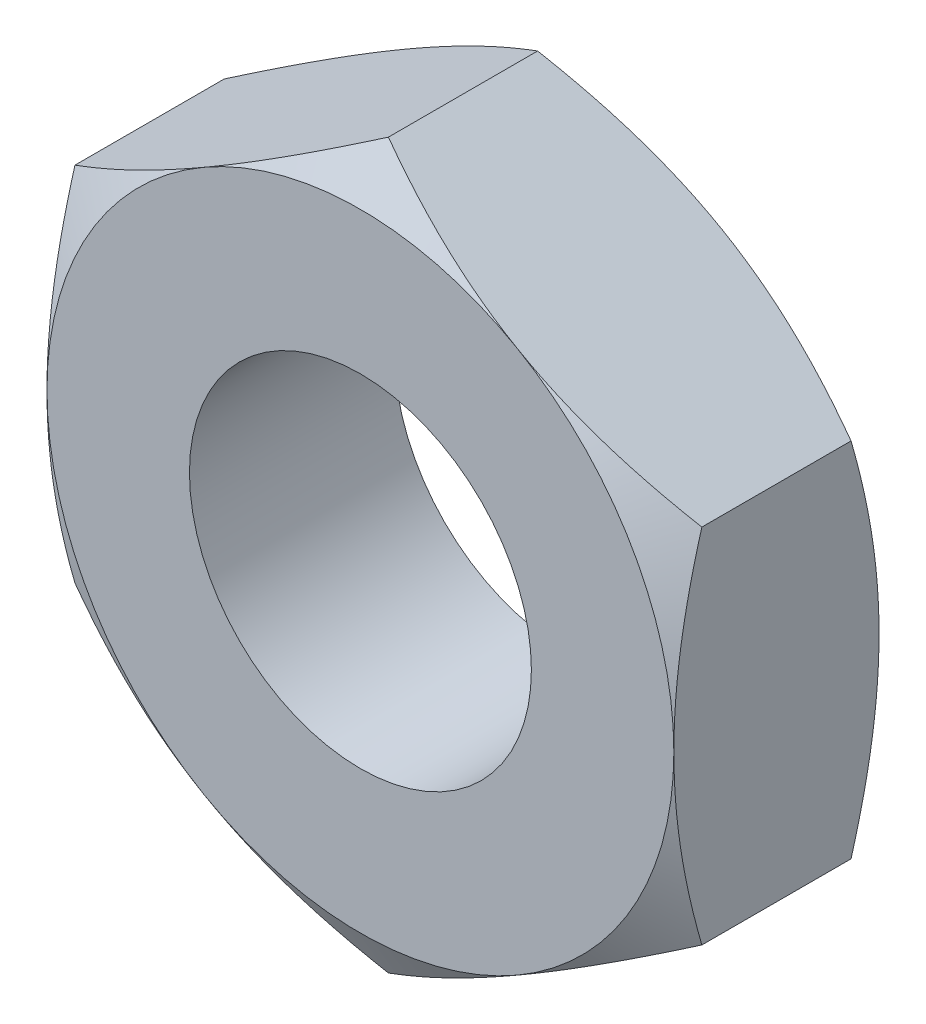
ISO-10303-21;
HEADER;
FILE_DESCRIPTION(('STEP AP214'),'2;1');
FILE_NAME('part.step','',(''),(''),'','','');
FILE_SCHEMA(('AUTOMOTIVE_DESIGN { 1 0 10303 214 1 1 1 1 }'));
ENDSEC;
DATA;
#1=APPLICATION_CONTEXT('core data for automotive mechanical design processes');
#2=APPLICATION_PROTOCOL_DEFINITION('international standard','automotive_design',2000,#1);
#3=PRODUCT_CONTEXT('',#1,'mechanical');
#4=PRODUCT('Part','Part','',(#3));
#5=PRODUCT_RELATED_PRODUCT_CATEGORY('part','',(#4));
#6=PRODUCT_DEFINITION_FORMATION('','',#4);
#7=PRODUCT_DEFINITION_CONTEXT('part definition',#1,'design');
#8=PRODUCT_DEFINITION('design','',#6,#7);
#9=PRODUCT_DEFINITION_SHAPE('','',#8);
#10=(LENGTH_UNIT() NAMED_UNIT(*) SI_UNIT(.MILLI.,.METRE.));
#11=(NAMED_UNIT(*) PLANE_ANGLE_UNIT() SI_UNIT($,.RADIAN.));
#12=(NAMED_UNIT(*) SI_UNIT($,.STERADIAN.) SOLID_ANGLE_UNIT());
#13=UNCERTAINTY_MEASURE_WITH_UNIT(LENGTH_MEASURE(1.E-05),#10,'distance_accuracy_value','');
#14=(GEOMETRIC_REPRESENTATION_CONTEXT(3) GLOBAL_UNCERTAINTY_ASSIGNED_CONTEXT((#13)) GLOBAL_UNIT_ASSIGNED_CONTEXT((#10,
#11,#12)) REPRESENTATION_CONTEXT('',''));
#15=CARTESIAN_POINT('',(0.,0.,0.));
#16=DIRECTION('',(0.,0.,1.));
#17=DIRECTION('',(1.,0.,0.));
#18=AXIS2_PLACEMENT_3D('',#15,#16,#17);
#19=CARTESIAN_POINT('',(-2.75,4.76313972081441,0.));
#20=DIRECTION('',(0.,0.,-1.));
#21=DIRECTION('',(-1.,0.,0.));
#22=AXIS2_PLACEMENT_3D('',#19,#20,#21);
#23=PLANE('',#22);
#24=CARTESIAN_POINT('',(0.,0.,0.));
#25=DIRECTION('',(0.,0.,1.));
#26=DIRECTION('',(1.,0.,0.));
#27=AXIS2_PLACEMENT_3D('',#24,#25,#26);
#28=CIRCLE('',#27,1.5);
#29=CARTESIAN_POINT('',(1.5,0.,0.));
#30=VERTEX_POINT('',#29);
#31=EDGE_CURVE('E335',#30,#30,#28,.T.);
#32=ORIENTED_EDGE('',*,*,#31,.F.);
#33=EDGE_LOOP('',(#32));
#34=FACE_BOUND('',#33,.T.);
#35=CARTESIAN_POINT('',(0.,0.,0.));
#36=DIRECTION('',(0.,0.,-1.));
#37=DIRECTION('',(-1.,0.,0.));
#38=AXIS2_PLACEMENT_3D('',#35,#36,#37);
#39=CIRCLE('',#38,2.75);
#40=CARTESIAN_POINT('',(-2.75,0.,0.));
#41=VERTEX_POINT('',#40);
#42=CARTESIAN_POINT('',(-1.375,2.38156986040721,0.));
#43=VERTEX_POINT('',#42);
#44=EDGE_CURVE('E343',#41,#43,#39,.T.);
#45=ORIENTED_EDGE('',*,*,#44,.F.);
#46=CARTESIAN_POINT('',(0.,0.,0.));
#47=DIRECTION('',(0.,0.,-1.));
#48=DIRECTION('',(-1.,0.,0.));
#49=AXIS2_PLACEMENT_3D('',#46,#47,#48);
#50=CIRCLE('',#49,2.75);
#51=CARTESIAN_POINT('',(-1.375,-2.38156986040721,0.));
#52=VERTEX_POINT('',#51);
#53=EDGE_CURVE('E154',#41,#52,#50,.F.);
#54=ORIENTED_EDGE('',*,*,#53,.T.);
#55=CARTESIAN_POINT('',(1.375,-2.38156986040721,0.));
#56=VERTEX_POINT('',#55);
#57=EDGE_CURVE('E264',#52,#56,#50,.F.);
#58=ORIENTED_EDGE('',*,*,#57,.T.);
#59=CARTESIAN_POINT('',(2.75,0.,0.));
#60=VERTEX_POINT('',#59);
#61=EDGE_CURVE('E157',#56,#60,#50,.F.);
#62=ORIENTED_EDGE('',*,*,#61,.T.);
#63=CARTESIAN_POINT('',(1.375,2.38156986040721,0.));
#64=VERTEX_POINT('',#63);
#65=EDGE_CURVE('E132',#60,#64,#50,.F.);
#66=ORIENTED_EDGE('',*,*,#65,.T.);
#67=EDGE_CURVE('E145',#64,#43,#50,.F.);
#68=ORIENTED_EDGE('',*,*,#67,.T.);
#69=EDGE_LOOP('',(#45,#54,#58,#62,#66,#68));
#70=FACE_BOUND('',#69,.T.);
#71=ADVANCED_FACE('F37',(#34,#70),#23,.F.);
#72=CARTESIAN_POINT('',(0.,0.,0.));
#73=DIRECTION('',(0.,0.,-1.));
#74=DIRECTION('',(-1.,0.,0.));
#75=AXIS2_PLACEMENT_3D('',#72,#73,#74);
#76=CONICAL_SURFACE('',#75,2.75,1.0471975511966);
#77=CARTESIAN_POINT('',(-2.75,-4.30229228147668,-1.36029280196869));
#78=CARTESIAN_POINT('',(-2.75,-4.18186505442104,-1.3017250140567));
#79=CARTESIAN_POINT('',(-2.75,-4.06116538069348,-1.24370803548682));
#80=CARTESIAN_POINT('',(-2.75,-3.81907640316823,-1.1290847342029));
#81=CARTESIAN_POINT('',(-2.75,-3.697686997625,-1.07247862661559));
#82=CARTESIAN_POINT('',(-2.75,-3.45346615214402,-0.960709275736212));
#83=CARTESIAN_POINT('',(-2.75,-3.33063048103345,-0.905555246476192));
#84=CARTESIAN_POINT('',(-2.75,-3.08399522164822,-0.797454597098009));
#85=CARTESIAN_POINT('',(-2.75,-2.96019567814277,-0.744507875173905));
#86=CARTESIAN_POINT('',(-2.75,-2.70729166016796,-0.639685660399076));
#87=CARTESIAN_POINT('',(-2.75,-2.57814783802132,-0.58790459291251));
#88=CARTESIAN_POINT('',(-2.75,-2.31836315787341,-0.488171403386151));
#89=CARTESIAN_POINT('',(-2.75,-2.18772213574267,-0.44021970581953));
#90=CARTESIAN_POINT('',(-2.75,-1.92496791263435,-0.349376696825143));
#91=CARTESIAN_POINT('',(-2.75,-1.79285817890918,-0.306475455624911));
#92=CARTESIAN_POINT('',(-2.75,-1.52674378198286,-0.227085219956575));
#93=CARTESIAN_POINT('',(-2.75,-1.39273971792532,-0.190594244981413));
#94=CARTESIAN_POINT('',(-2.75,-1.12351567917363,-0.12594817987629));
#95=CARTESIAN_POINT('',(-2.75,-0.988307144223034,-0.0977463139476861));
#96=CARTESIAN_POINT('',(-2.75,-0.716169711836455,-0.0512440134294212));
#97=CARTESIAN_POINT('',(-2.75,-0.579240989145488,-0.0329425812960641));
#98=CARTESIAN_POINT('',(-2.75,-0.306150866410057,-0.00793911298407926));
#99=CARTESIAN_POINT('',(-2.75,-0.170003735405166,-0.00108506805388398));
#100=CARTESIAN_POINT('',(-2.75,0.10238659817697,0.000845105282767546));
#101=CARTESIAN_POINT('',(-2.75,0.238629801806978,-0.00407889744443084));
#102=CARTESIAN_POINT('',(-2.75,0.468832296084481,-0.0219974968310409));
#103=CARTESIAN_POINT('',(-2.75,0.563033315185619,-0.032077711231205));
#104=CARTESIAN_POINT('',(-2.75,0.750767930146559,-0.0572609204033267));
#105=CARTESIAN_POINT('',(-2.75,0.844301437764612,-0.0723645671300336));
#106=CARTESIAN_POINT('',(-2.75,1.12375156526666,-0.124421461575699));
#107=CARTESIAN_POINT('',(-2.75,1.30841788504052,-0.168111837418328));
#108=CARTESIAN_POINT('',(-2.75,1.67808290983454,-0.269824298472284));
#109=CARTESIAN_POINT('',(-2.75,1.86299578104003,-0.328146457720436));
#110=CARTESIAN_POINT('',(-2.75,2.13779064230023,-0.422867035191401));
#111=CARTESIAN_POINT('',(-2.75,2.22895170938592,-0.455643485568147));
#112=CARTESIAN_POINT('',(-2.75,2.41051603082026,-0.523231455804624));
#113=CARTESIAN_POINT('',(-2.75,2.50091929547193,-0.558042947944627));
#114=CARTESIAN_POINT('',(-2.75,2.71959159850898,-0.644617652729879));
#115=CARTESIAN_POINT('',(-2.75,2.84751132012684,-0.697260776865983));
#116=CARTESIAN_POINT('',(-2.75,3.10220956373745,-0.805245997048298));
#117=CARTESIAN_POINT('',(-2.75,3.22898800879945,-0.860588273447927));
#118=CARTESIAN_POINT('',(-2.75,3.60796752116446,-1.02979754269534));
#119=CARTESIAN_POINT('',(-2.75,3.8587556505728,-1.14682372491926));
#120=CARTESIAN_POINT('',(-2.75,4.35800728856469,-1.38637465943305));
#121=CARTESIAN_POINT('',(-2.75,4.60646787012847,-1.50890543938444));
#122=CARTESIAN_POINT('',(-2.75,5.10156571292321,-1.75761178381209));
#123=CARTESIAN_POINT('',(-2.75,5.34820290174554,-1.8837874920658));
#124=CARTESIAN_POINT('',(-2.75,5.81846534399675,-2.12744912898035));
#125=CARTESIAN_POINT('',(-2.75,6.04220224364605,-2.24472037105475));
#126=CARTESIAN_POINT('',(-2.75,6.48884803452161,-2.48084931078627));
#127=CARTESIAN_POINT('',(-2.75,6.71175689181135,-2.59970707256807));
#128=CARTESIAN_POINT('',(-2.75,7.15632571780262,-2.83830005036305));
#129=CARTESIAN_POINT('',(-2.75,7.37798743393472,-2.95803201529397));
#130=CARTESIAN_POINT('',(-2.75,7.82078437408361,-3.19843421061186));
#131=CARTESIAN_POINT('',(-2.75,8.04191962909866,-3.31910438387787));
#132=CARTESIAN_POINT('',(-2.75,8.26286285963033,-3.44012269702325));
#133=B_SPLINE_CURVE_WITH_KNOTS('',3,(#77,#78,#79,#80,#81,#82,#83,#84,#85,#86,#87,#88,#89,#90,
#91,#92,#93,#94,#95,#96,#97,#98,#99,#100,#101,#102,#103,#104,#105,#106,#107,#108,#109,#110,#111,
#112,#113,#114,#115,#116,#117,#118,#119,#120,#121,#122,#123,#124,#125,#126,#127,#128,#129,#130,
#131,#132),.UNSPECIFIED.,.F.,.F.,(4,2,2,2,2,2,2,2,2,2,2,2,2,2,2,2,2,2,2,2,2,2,2,2,2,2,2,4),(0.,
0.401746095804053,0.803553078856815,1.20748507156767,1.61139841337565,2.02876570151725,
2.44617918943111,2.86275778118177,3.27920744014808,3.69325983350295,4.10727050016889,
4.51573852765934,4.9242111029455,5.20829154114386,5.49240886247226,6.06094297681273,
6.64225664207598,6.93286080176163,7.2234610039895,7.63840452536262,8.05337581074357,
8.8835032709366,9.71456302015113,10.5456555961473,11.3034719076264,12.0613189421837,
12.8171120728199,13.5728595432957),.UNSPECIFIED.);
#134=CARTESIAN_POINT('',(-2.75,1.58771324027148,-0.245620093061861));
#135=VERTEX_POINT('',#134);
#136=EDGE_CURVE('E162',#135,#41,#133,.F.);
#137=ORIENTED_EDGE('',*,*,#136,.T.);
#138=ORIENTED_EDGE('',*,*,#44,.T.);
#139=CARTESIAN_POINT('',(0.0002,3.17554195059678,-0.245686763364759));
#140=CARTESIAN_POINT('',(-0.120649220659906,3.10576962051743,-0.205387662249262));
#141=CARTESIAN_POINT('',(-0.242541602622634,3.03539502097908,-0.168736902597662));
#142=CARTESIAN_POINT('',(-0.488437126727893,2.89342717394439,-0.104762182969801));
#143=CARTESIAN_POINT('',(-0.612444638573856,2.82183140359859,-0.077460855674498));
#144=CARTESIAN_POINT('',(-0.858922797975944,2.67952717191843,-0.0349617452941179));
#145=CARTESIAN_POINT('',(-0.981355518587418,2.60884060771578,-0.0194811186224591));
#146=CARTESIAN_POINT('',(-1.22679714236892,2.46713482015519,-0.000999397369942066));
#147=CARTESIAN_POINT('',(-1.34980515323291,2.39611611197038,0.00201700053739859));
#148=CARTESIAN_POINT('',(-1.57965878661079,2.26341005486545,-0.00425314542854834));
#149=CARTESIAN_POINT('',(-1.68653879125402,2.20170285541369,-0.0120001542767039));
#150=CARTESIAN_POINT('',(-1.89960246733475,2.07869048467395,-0.036555181064356));
#151=CARTESIAN_POINT('',(-2.00578540164889,2.01738573896434,-0.0533715896505714));
#152=CARTESIAN_POINT('',(-2.21928848939318,1.89411967378235,-0.095411922345957));
#153=CARTESIAN_POINT('',(-2.32658161614286,1.83217395817123,-0.120814080687231));
#154=CARTESIAN_POINT('',(-2.53956747928405,1.70920651275308,-0.178467225839982));
#155=CARTESIAN_POINT('',(-2.64526294502665,1.64818320715447,-0.210704663298982));
#156=CARTESIAN_POINT('',(-2.7502,1.58759777021764,-0.245686763364759));
#157=B_SPLINE_CURVE_WITH_KNOTS('',3,(#139,#140,#141,#142,#143,#144,#145,#146,#147,#148,#149,
#150,#151,#152,#153,#154,#155,#156),.UNSPECIFIED.,.F.,.F.,(4,2,2,2,2,2,2,2,4),(0.,
0.435912828725888,0.872873557116332,1.29901931904671,1.72464171213574,2.09526089052937,
2.46622354066374,2.84541551798557,3.22386274754524),.UNSPECIFIED.);
#158=EDGE_CURVE('E197',#43,#135,#157,.T.);
#159=ORIENTED_EDGE('',*,*,#158,.T.);
#160=EDGE_LOOP('',(#137,#138,#159));
#161=FACE_BOUND('',#160,.T.);
#162=ADVANCED_FACE('F184',(#161),#76,.T.);
#163=CARTESIAN_POINT('',(2.7502,1.58759777021764,-0.245686763364759));
#164=CARTESIAN_POINT('',(2.62935077934009,1.65737010029699,-0.205387662249262));
#165=CARTESIAN_POINT('',(2.50745839737737,1.72774469983534,-0.168736902597662));
#166=CARTESIAN_POINT('',(2.26156287327211,1.86971254687003,-0.104762182969801));
#167=CARTESIAN_POINT('',(2.13755536142614,1.94130831721583,-0.0774608556744981));
#168=CARTESIAN_POINT('',(1.89107720202406,2.08361254889599,-0.0349617452941181));
#169=CARTESIAN_POINT('',(1.76864448141258,2.15429911309865,-0.0194811186224593));
#170=CARTESIAN_POINT('',(1.52320285763108,2.29600490065923,-0.000999397369942144));
#171=CARTESIAN_POINT('',(1.40019484676709,2.36702360884404,0.00201700053739861));
#172=CARTESIAN_POINT('',(1.17034121338921,2.49972966594897,-0.00425314542854836));
#173=CARTESIAN_POINT('',(1.06346120874598,2.56143686540073,-0.012000154276704));
#174=CARTESIAN_POINT('',(0.85039753266525,2.68444923614047,-0.0365551810643561));
#175=CARTESIAN_POINT('',(0.74421459835111,2.74575398185008,-0.0533715896505714));
#176=CARTESIAN_POINT('',(0.530711510606816,2.86902004703207,-0.095411922345957));
#177=CARTESIAN_POINT('',(0.423418383857144,2.93096576264319,-0.120814080687231));
#178=CARTESIAN_POINT('',(0.210432520715948,3.05393320806134,-0.178467225839982));
#179=CARTESIAN_POINT('',(0.104737054973347,3.11495651365995,-0.210704663298982));
#180=CARTESIAN_POINT('',(-0.000200000000000198,3.17554195059678,-0.245686763364759));
#181=B_SPLINE_CURVE_WITH_KNOTS('',3,(#163,#164,#165,#166,#167,#168,#169,#170,#171,#172,#173,
#174,#175,#176,#177,#178,#179,#180),.UNSPECIFIED.,.F.,.F.,(4,2,2,2,2,2,2,2,4),(0.,
0.435912828725888,0.872873557116332,1.29901931904671,1.72464171213574,2.09526089052937,
2.46622354066374,2.84541551798557,3.22386274754524),.UNSPECIFIED.);
#182=CARTESIAN_POINT('',(0.,3.17542648054294,-0.245620093061861));
#183=VERTEX_POINT('',#182);
#184=EDGE_CURVE('E141',#64,#183,#181,.T.);
#185=ORIENTED_EDGE('',*,*,#184,.T.);
#186=EDGE_CURVE('E148',#183,#43,#157,.T.);
#187=ORIENTED_EDGE('',*,*,#186,.T.);
#188=ORIENTED_EDGE('',*,*,#67,.F.);
#189=EDGE_LOOP('',(#185,#187,#188));
#190=FACE_BOUND('',#189,.T.);
#191=ADVANCED_FACE('F146',(#190),#76,.T.);
#192=CARTESIAN_POINT('',(2.75,-4.30229228147668,-1.36029280196869));
#193=CARTESIAN_POINT('',(2.75,-4.18186505442104,-1.3017250140567));
#194=CARTESIAN_POINT('',(2.75,-4.06116538069348,-1.24370803548682));
#195=CARTESIAN_POINT('',(2.75,-3.81907640316823,-1.1290847342029));
#196=CARTESIAN_POINT('',(2.75,-3.697686997625,-1.07247862661559));
#197=CARTESIAN_POINT('',(2.75,-3.45346615214402,-0.960709275736212));
#198=CARTESIAN_POINT('',(2.75,-3.33063048103345,-0.905555246476192));
#199=CARTESIAN_POINT('',(2.75,-3.08399522164822,-0.797454597098009));
#200=CARTESIAN_POINT('',(2.75,-2.96019567814277,-0.744507875173905));
#201=CARTESIAN_POINT('',(2.75,-2.70729166016796,-0.639685660399076));
#202=CARTESIAN_POINT('',(2.75,-2.57814783802132,-0.58790459291251));
#203=CARTESIAN_POINT('',(2.75,-2.31836315787341,-0.488171403386151));
#204=CARTESIAN_POINT('',(2.75,-2.18772213574267,-0.44021970581953));
#205=CARTESIAN_POINT('',(2.75,-1.92496791263435,-0.349376696825143));
#206=CARTESIAN_POINT('',(2.75,-1.79285817890918,-0.306475455624911));
#207=CARTESIAN_POINT('',(2.75,-1.52674378198286,-0.227085219956575));
#208=CARTESIAN_POINT('',(2.75,-1.39273971792532,-0.190594244981413));
#209=CARTESIAN_POINT('',(2.75,-1.12351567917363,-0.12594817987629));
#210=CARTESIAN_POINT('',(2.75,-0.988307144223034,-0.0977463139476861));
#211=CARTESIAN_POINT('',(2.75,-0.716169711836455,-0.0512440134294212));
#212=CARTESIAN_POINT('',(2.75,-0.579240989145488,-0.0329425812960641));
#213=CARTESIAN_POINT('',(2.75,-0.306150866410057,-0.00793911298407926));
#214=CARTESIAN_POINT('',(2.75,-0.170003735405166,-0.00108506805388398));
#215=CARTESIAN_POINT('',(2.75,0.10238659817697,0.000845105282767546));
#216=CARTESIAN_POINT('',(2.75,0.238629801806978,-0.00407889744443084));
#217=CARTESIAN_POINT('',(2.75,0.468832296084481,-0.0219974968310409));
#218=CARTESIAN_POINT('',(2.75,0.563033315185619,-0.032077711231205));
#219=CARTESIAN_POINT('',(2.75,0.750767930146559,-0.0572609204033267));
#220=CARTESIAN_POINT('',(2.75,0.844301437764612,-0.0723645671300336));
#221=CARTESIAN_POINT('',(2.75,1.12375156526666,-0.124421461575699));
#222=CARTESIAN_POINT('',(2.75,1.30841788504052,-0.168111837418328));
#223=CARTESIAN_POINT('',(2.75,1.67808290983454,-0.269824298472284));
#224=CARTESIAN_POINT('',(2.75,1.86299578104003,-0.328146457720436));
#225=CARTESIAN_POINT('',(2.75,2.13779064230023,-0.422867035191401));
#226=CARTESIAN_POINT('',(2.75,2.22895170938592,-0.455643485568147));
#227=CARTESIAN_POINT('',(2.75,2.41051603082026,-0.523231455804624));
#228=CARTESIAN_POINT('',(2.75,2.50091929547193,-0.558042947944627));
#229=CARTESIAN_POINT('',(2.75,2.71959159850898,-0.644617652729879));
#230=CARTESIAN_POINT('',(2.75,2.84751132012684,-0.697260776865983));
#231=CARTESIAN_POINT('',(2.75,3.10220956373745,-0.805245997048298));
#232=CARTESIAN_POINT('',(2.75,3.22898800879945,-0.860588273447927));
#233=CARTESIAN_POINT('',(2.75,3.60796752116446,-1.02979754269534));
#234=CARTESIAN_POINT('',(2.75,3.8587556505728,-1.14682372491926));
#235=CARTESIAN_POINT('',(2.75,4.35800728856469,-1.38637465943305));
#236=CARTESIAN_POINT('',(2.75,4.60646787012847,-1.50890543938444));
#237=CARTESIAN_POINT('',(2.75,5.10156571292321,-1.75761178381209));
#238=CARTESIAN_POINT('',(2.75,5.34820290174554,-1.8837874920658));
#239=CARTESIAN_POINT('',(2.75,5.81846534399675,-2.12744912898035));
#240=CARTESIAN_POINT('',(2.75,6.04220224364605,-2.24472037105475));
#241=CARTESIAN_POINT('',(2.75,6.48884803452161,-2.48084931078627));
#242=CARTESIAN_POINT('',(2.75,6.71175689181135,-2.59970707256807));
#243=CARTESIAN_POINT('',(2.75,7.15632571780262,-2.83830005036305));
#244=CARTESIAN_POINT('',(2.75,7.37798743393472,-2.95803201529397));
#245=CARTESIAN_POINT('',(2.75,7.82078437408361,-3.19843421061186));
#246=CARTESIAN_POINT('',(2.75,8.04191962909866,-3.31910438387787));
#247=CARTESIAN_POINT('',(2.75,8.26286285963033,-3.44012269702325));
#248=B_SPLINE_CURVE_WITH_KNOTS('',3,(#192,#193,#194,#195,#196,#197,#198,#199,#200,#201,#202,
#203,#204,#205,#206,#207,#208,#209,#210,#211,#212,#213,#214,#215,#216,#217,#218,#219,#220,#221,
#222,#223,#224,#225,#226,#227,#228,#229,#230,#231,#232,#233,#234,#235,#236,#237,#238,#239,#240,
#241,#242,#243,#244,#245,#246,#247),.UNSPECIFIED.,.F.,.F.,(4,2,2,2,2,2,2,2,2,2,2,2,2,2,2,2,2,2,
2,2,2,2,2,2,2,2,2,4),(0.,0.401746095804053,0.803553078856815,1.20748507156767,1.61139841337565,
2.02876570151725,2.44617918943111,2.86275778118177,3.27920744014808,3.69325983350295,
4.10727050016889,4.51573852765934,4.9242111029455,5.20829154114386,5.49240886247226,
6.06094297681273,6.64225664207598,6.93286080176163,7.2234610039895,7.63840452536262,
8.05337581074357,8.8835032709366,9.71456302015113,10.5456555961473,11.3034719076264,
12.0613189421837,12.8171120728199,13.5728595432957),.UNSPECIFIED.);
#249=CARTESIAN_POINT('',(2.75,1.58771324027148,-0.245620093061861));
#250=VERTEX_POINT('',#249);
#251=EDGE_CURVE('E135',#60,#250,#248,.T.);
#252=ORIENTED_EDGE('',*,*,#251,.T.);
#253=EDGE_CURVE('E128',#250,#64,#181,.T.);
#254=ORIENTED_EDGE('',*,*,#253,.T.);
#255=ORIENTED_EDGE('',*,*,#65,.F.);
#256=EDGE_LOOP('',(#252,#254,#255));
#257=FACE_BOUND('',#256,.T.);
#258=ADVANCED_FACE('F130',(#257),#76,.T.);
#259=CARTESIAN_POINT('',(-0.0002,-3.17554195059678,-0.245686763364759));
#260=CARTESIAN_POINT('',(0.120649220659906,-3.10576962051743,-0.205387662249262));
#261=CARTESIAN_POINT('',(0.242541602622634,-3.03539502097908,-0.168736902597662));
#262=CARTESIAN_POINT('',(0.488437126727893,-2.89342717394439,-0.104762182969801));
#263=CARTESIAN_POINT('',(0.612444638573856,-2.82183140359859,-0.077460855674498));
#264=CARTESIAN_POINT('',(0.858922797975944,-2.67952717191843,-0.0349617452941179));
#265=CARTESIAN_POINT('',(0.981355518587418,-2.60884060771578,-0.0194811186224591));
#266=CARTESIAN_POINT('',(1.22679714236892,-2.46713482015519,-0.000999397369942066));
#267=CARTESIAN_POINT('',(1.34980515323291,-2.39611611197038,0.00201700053739859));
#268=CARTESIAN_POINT('',(1.57965878661079,-2.26341005486545,-0.00425314542854834));
#269=CARTESIAN_POINT('',(1.68653879125402,-2.20170285541369,-0.0120001542767039));
#270=CARTESIAN_POINT('',(1.89960246733475,-2.07869048467395,-0.036555181064356));
#271=CARTESIAN_POINT('',(2.00578540164889,-2.01738573896434,-0.0533715896505714));
#272=CARTESIAN_POINT('',(2.21928848939318,-1.89411967378235,-0.095411922345957));
#273=CARTESIAN_POINT('',(2.32658161614286,-1.83217395817123,-0.120814080687231));
#274=CARTESIAN_POINT('',(2.53956747928405,-1.70920651275308,-0.178467225839982));
#275=CARTESIAN_POINT('',(2.64526294502665,-1.64818320715447,-0.210704663298982));
#276=CARTESIAN_POINT('',(2.7502,-1.58759777021764,-0.245686763364759));
#277=B_SPLINE_CURVE_WITH_KNOTS('',3,(#259,#260,#261,#262,#263,#264,#265,#266,#267,#268,#269,
#270,#271,#272,#273,#274,#275,#276),.UNSPECIFIED.,.F.,.F.,(4,2,2,2,2,2,2,2,4),(0.,
0.435912828725888,0.872873557116332,1.29901931904671,1.72464171213574,2.09526089052937,
2.46622354066374,2.84541551798557,3.22386274754524),.UNSPECIFIED.);
#278=CARTESIAN_POINT('',(2.75,-1.5877132402717,-0.245620093061715));
#279=VERTEX_POINT('',#278);
#280=EDGE_CURVE('E213',#56,#279,#277,.T.);
#281=ORIENTED_EDGE('',*,*,#280,.T.);
#282=EDGE_CURVE('E212',#279,#60,#248,.T.);
#283=ORIENTED_EDGE('',*,*,#282,.T.);
#284=ORIENTED_EDGE('',*,*,#61,.F.);
#285=EDGE_LOOP('',(#281,#283,#284));
#286=FACE_BOUND('',#285,.T.);
#287=ADVANCED_FACE('F444',(#286),#76,.T.);
#288=CARTESIAN_POINT('',(0.,-3.17542648054294,-0.245620093061861));
#289=VERTEX_POINT('',#288);
#290=EDGE_CURVE('E274',#289,#56,#277,.T.);
#291=ORIENTED_EDGE('',*,*,#290,.T.);
#292=ORIENTED_EDGE('',*,*,#57,.F.);
#293=CARTESIAN_POINT('',(-2.7502,-1.58759777021764,-0.245686763364759));
#294=CARTESIAN_POINT('',(-2.62935077934009,-1.65737010029699,-0.205387662249262));
#295=CARTESIAN_POINT('',(-2.50745839737737,-1.72774469983534,-0.168736902597662));
#296=CARTESIAN_POINT('',(-2.26156287327211,-1.86971254687003,-0.104762182969801));
#297=CARTESIAN_POINT('',(-2.13755536142614,-1.94130831721583,-0.0774608556744981));
#298=CARTESIAN_POINT('',(-1.89107720202406,-2.08361254889599,-0.0349617452941181));
#299=CARTESIAN_POINT('',(-1.76864448141258,-2.15429911309865,-0.0194811186224593));
#300=CARTESIAN_POINT('',(-1.52320285763108,-2.29600490065923,-0.000999397369942144));
#301=CARTESIAN_POINT('',(-1.40019484676709,-2.36702360884404,0.00201700053739861));
#302=CARTESIAN_POINT('',(-1.17034121338921,-2.49972966594897,-0.00425314542854836));
#303=CARTESIAN_POINT('',(-1.06346120874598,-2.56143686540073,-0.012000154276704));
#304=CARTESIAN_POINT('',(-0.85039753266525,-2.68444923614047,-0.0365551810643561));
#305=CARTESIAN_POINT('',(-0.74421459835111,-2.74575398185008,-0.0533715896505714));
#306=CARTESIAN_POINT('',(-0.530711510606816,-2.86902004703207,-0.095411922345957));
#307=CARTESIAN_POINT('',(-0.423418383857144,-2.93096576264319,-0.120814080687231));
#308=CARTESIAN_POINT('',(-0.210432520715948,-3.05393320806134,-0.178467225839982));
#309=CARTESIAN_POINT('',(-0.104737054973347,-3.11495651365995,-0.210704663298982));
#310=CARTESIAN_POINT('',(0.000200000000000198,-3.17554195059678,-0.245686763364759));
#311=B_SPLINE_CURVE_WITH_KNOTS('',3,(#293,#294,#295,#296,#297,#298,#299,#300,#301,#302,#303,
#304,#305,#306,#307,#308,#309,#310),.UNSPECIFIED.,.F.,.F.,(4,2,2,2,2,2,2,2,4),(0.,
0.435912828725888,0.872873557116332,1.29901931904671,1.72464171213574,2.09526089052937,
2.46622354066374,2.84541551798557,3.22386274754524),.UNSPECIFIED.);
#312=EDGE_CURVE('E278',#52,#289,#311,.T.);
#313=ORIENTED_EDGE('',*,*,#312,.T.);
#314=EDGE_LOOP('',(#291,#292,#313));
#315=FACE_BOUND('',#314,.T.);
#316=ADVANCED_FACE('F190',(#315),#76,.T.);
#317=CARTESIAN_POINT('',(-2.75,-1.5877132402717,-0.245620093061715));
#318=VERTEX_POINT('',#317);
#319=EDGE_CURVE('E177',#318,#52,#311,.T.);
#320=ORIENTED_EDGE('',*,*,#319,.T.);
#321=ORIENTED_EDGE('',*,*,#53,.F.);
#322=EDGE_CURVE('E140',#41,#318,#133,.F.);
#323=ORIENTED_EDGE('',*,*,#322,.T.);
#324=EDGE_LOOP('',(#320,#321,#323));
#325=FACE_BOUND('',#324,.T.);
#326=ADVANCED_FACE('F283',(#325),#76,.T.);
#327=CARTESIAN_POINT('',(2.75,1.58771324027148,-1.8));
#328=DIRECTION('',(0.499999999999999,0.866025403784439,0.));
#329=DIRECTION('',(-0.866025403784439,0.499999999999999,0.));
#330=AXIS2_PLACEMENT_3D('',#327,#328,#329);
#331=PLANE('',#330);
#332=CARTESIAN_POINT('',(-0.0002,3.17554195059678,-1.55431323663524));
#333=CARTESIAN_POINT('',(0.120649220659906,3.10576962051743,-1.59461233775074));
#334=CARTESIAN_POINT('',(0.242541602622634,3.03539502097908,-1.63126309740234));
#335=CARTESIAN_POINT('',(0.488437126727893,2.89342717394439,-1.6952378170302));
#336=CARTESIAN_POINT('',(0.612444638573856,2.82183140359859,-1.7225391443255));
#337=CARTESIAN_POINT('',(0.858922797975944,2.67952717191843,-1.76503825470588));
#338=CARTESIAN_POINT('',(0.981355518587418,2.60884060771577,-1.78051888137754));
#339=CARTESIAN_POINT('',(1.22679714236892,2.46713482015519,-1.79900060263006));
#340=CARTESIAN_POINT('',(1.34980515323291,2.39611611197038,-1.8020170005374));
#341=CARTESIAN_POINT('',(1.57965878661079,2.26341005486545,-1.79574685457145));
#342=CARTESIAN_POINT('',(1.68653879125402,2.20170285541369,-1.7879998457233));
#343=CARTESIAN_POINT('',(1.89960246733475,2.07869048467395,-1.76344481893564));
#344=CARTESIAN_POINT('',(2.00578540164889,2.01738573896434,-1.74662841034943));
#345=CARTESIAN_POINT('',(2.21928848939318,1.89411967378235,-1.70458807765404));
#346=CARTESIAN_POINT('',(2.32658161614286,1.83217395817123,-1.67918591931277));
#347=CARTESIAN_POINT('',(2.53956747928405,1.70920651275308,-1.62153277416002));
#348=CARTESIAN_POINT('',(2.64526294502665,1.64818320715447,-1.58929533670102));
#349=CARTESIAN_POINT('',(2.7502,1.58759777021764,-1.55431323663524));
#350=B_SPLINE_CURVE_WITH_KNOTS('',3,(#332,#333,#334,#335,#336,#337,#338,#339,#340,#341,#342,
#343,#344,#345,#346,#347,#348,#349),.UNSPECIFIED.,.F.,.F.,(4,2,2,2,2,2,2,2,4),(0.,
0.435912828725888,0.872873557116332,1.29901931904672,1.72464171213574,2.09526089052937,
2.46622354066374,2.84541551798557,3.22386274754524),.UNSPECIFIED.);
#351=CARTESIAN_POINT('',(0.,3.17542648054294,-1.55437990693814));
#352=VERTEX_POINT('',#351);
#353=CARTESIAN_POINT('',(1.375,2.38156986040721,-1.8));
#354=VERTEX_POINT('',#353);
#355=EDGE_CURVE('E249',#352,#354,#350,.T.);
#356=ORIENTED_EDGE('',*,*,#355,.F.);
#357=DIRECTION('',(0.,0.,1.));
#358=VECTOR('',#357,1.);
#359=CARTESIAN_POINT('',(0.,3.17542648054294,-1.8));
#360=LINE('',#359,#358);
#361=EDGE_CURVE('E161',#352,#183,#360,.T.);
#362=ORIENTED_EDGE('',*,*,#361,.T.);
#363=ORIENTED_EDGE('',*,*,#184,.F.);
#364=ORIENTED_EDGE('',*,*,#253,.F.);
#365=DIRECTION('',(0.,0.,1.));
#366=VECTOR('',#365,1.);
#367=CARTESIAN_POINT('',(2.75,1.58771324027148,-1.8));
#368=LINE('',#367,#366);
#369=CARTESIAN_POINT('',(2.75,1.58771324027148,-1.55437990693814));
#370=VERTEX_POINT('',#369);
#371=EDGE_CURVE('E153',#370,#250,#368,.T.);
#372=ORIENTED_EDGE('',*,*,#371,.F.);
#373=EDGE_CURVE('E243',#354,#370,#350,.T.);
#374=ORIENTED_EDGE('',*,*,#373,.F.);
#375=EDGE_LOOP('',(#356,#362,#363,#364,#372,#374));
#376=FACE_BOUND('',#375,.T.);
#377=ADVANCED_FACE('F39',(#376),#331,.T.);
#378=CARTESIAN_POINT('',(2.75,-1.58771324027148,-1.8));
#379=DIRECTION('',(1.,0.,0.));
#380=DIRECTION('',(0.,0.,-1.));
#381=AXIS2_PLACEMENT_3D('',#378,#379,#380);
#382=PLANE('',#381);
#383=CARTESIAN_POINT('',(2.75,-4.30229228147668,-0.439707198031312));
#384=CARTESIAN_POINT('',(2.75,-4.18186505442105,-0.498274985943303));
#385=CARTESIAN_POINT('',(2.75,-4.06116538069348,-0.556291964513185));
#386=CARTESIAN_POINT('',(2.75,-3.81907640316823,-0.670915265797105));
#387=CARTESIAN_POINT('',(2.75,-3.697686997625,-0.727521373384408));
#388=CARTESIAN_POINT('',(2.75,-3.45346615214402,-0.83929072426379));
#389=CARTESIAN_POINT('',(2.75,-3.33063048103345,-0.894444753523809));
#390=CARTESIAN_POINT('',(2.75,-3.08399522164822,-1.00254540290199));
#391=CARTESIAN_POINT('',(2.75,-2.96019567814277,-1.0554921248261));
#392=CARTESIAN_POINT('',(2.75,-2.70729166016796,-1.16031433960093));
#393=CARTESIAN_POINT('',(2.75,-2.57814783802132,-1.21209540708749));
#394=CARTESIAN_POINT('',(2.75,-2.31836315787341,-1.31182859661385));
#395=CARTESIAN_POINT('',(2.75,-2.18772213574267,-1.35978029418047));
#396=CARTESIAN_POINT('',(2.75,-1.92496791263435,-1.45062330317486));
#397=CARTESIAN_POINT('',(2.75,-1.79285817890918,-1.49352454437509));
#398=CARTESIAN_POINT('',(2.75,-1.52674378198286,-1.57291478004343));
#399=CARTESIAN_POINT('',(2.75,-1.39273971792532,-1.60940575501859));
#400=CARTESIAN_POINT('',(2.75,-1.12351567917363,-1.67405182012371));
#401=CARTESIAN_POINT('',(2.75,-0.988307144223034,-1.70225368605231));
#402=CARTESIAN_POINT('',(2.75,-0.716169711836454,-1.74875598657058));
#403=CARTESIAN_POINT('',(2.75,-0.579240989145487,-1.76705741870394));
#404=CARTESIAN_POINT('',(2.75,-0.306150866410056,-1.79206088701592));
#405=CARTESIAN_POINT('',(2.75,-0.170003735405164,-1.79891493194612));
#406=CARTESIAN_POINT('',(2.75,0.102386598176971,-1.80084510528277));
#407=CARTESIAN_POINT('',(2.75,0.238629801806978,-1.79592110255557));
#408=CARTESIAN_POINT('',(2.75,0.468832296084481,-1.77800250316896));
#409=CARTESIAN_POINT('',(2.75,0.563033315185619,-1.7679222887688));
#410=CARTESIAN_POINT('',(2.75,0.75076793014656,-1.74273907959667));
#411=CARTESIAN_POINT('',(2.75,0.844301437764612,-1.72763543286997));
#412=CARTESIAN_POINT('',(2.75,1.12375156526666,-1.6755785384243));
#413=CARTESIAN_POINT('',(2.75,1.30841788504052,-1.63188816258167));
#414=CARTESIAN_POINT('',(2.75,1.67808290983454,-1.53017570152772));
#415=CARTESIAN_POINT('',(2.75,1.86299578104003,-1.47185354227956));
#416=CARTESIAN_POINT('',(2.75,2.13779064230023,-1.3771329648086));
#417=CARTESIAN_POINT('',(2.75,2.22895170938592,-1.34435651443185));
#418=CARTESIAN_POINT('',(2.75,2.41051603082027,-1.27676854419538));
#419=CARTESIAN_POINT('',(2.75,2.50091929547194,-1.24195705205537));
#420=CARTESIAN_POINT('',(2.75,2.71959159850898,-1.15538234727012));
#421=CARTESIAN_POINT('',(2.75,2.84751132012684,-1.10273922313402));
#422=CARTESIAN_POINT('',(2.75,3.10220956373745,-0.994754002951703));
#423=CARTESIAN_POINT('',(2.75,3.22898800879945,-0.939411726552075));
#424=CARTESIAN_POINT('',(2.75,3.60796752116446,-0.770202457304665));
#425=CARTESIAN_POINT('',(2.75,3.8587556505728,-0.65317627508074));
#426=CARTESIAN_POINT('',(2.75,4.35800728856469,-0.413625340566956));
#427=CARTESIAN_POINT('',(2.75,4.60646787012847,-0.291094560615558));
#428=CARTESIAN_POINT('',(2.75,5.10156571292321,-0.042388216187914));
#429=CARTESIAN_POINT('',(2.75,5.34820290174554,0.0837874920657999));
#430=CARTESIAN_POINT('',(2.75,5.81846534399675,0.327449128980342));
#431=CARTESIAN_POINT('',(2.75,6.04220224364605,0.44472037105475));
#432=CARTESIAN_POINT('',(2.75,6.48884803452161,0.680849310786269));
#433=CARTESIAN_POINT('',(2.75,6.71175689181135,0.799707072568062));
#434=CARTESIAN_POINT('',(2.75,7.15632571780262,1.03830005036305));
#435=CARTESIAN_POINT('',(2.75,7.37798743393472,1.15803201529397));
#436=CARTESIAN_POINT('',(2.75,7.82078437408362,1.39843421061186));
#437=CARTESIAN_POINT('',(2.75,8.04191962909866,1.51910438387786));
#438=CARTESIAN_POINT('',(2.75,8.26286285963033,1.64012269702325));
#439=B_SPLINE_CURVE_WITH_KNOTS('',3,(#383,#384,#385,#386,#387,#388,#389,#390,#391,#392,#393,
#394,#395,#396,#397,#398,#399,#400,#401,#402,#403,#404,#405,#406,#407,#408,#409,#410,#411,#412,
#413,#414,#415,#416,#417,#418,#419,#420,#421,#422,#423,#424,#425,#426,#427,#428,#429,#430,#431,
#432,#433,#434,#435,#436,#437,#438),.UNSPECIFIED.,.F.,.F.,(4,2,2,2,2,2,2,2,2,2,2,2,2,2,2,2,2,2,
2,2,2,2,2,2,2,2,2,4),(0.,0.401746095804055,0.803553078856816,1.20748507156767,1.61139841337565,
2.02876570151725,2.44617918943111,2.86275778118177,3.27920744014808,3.69325983350295,
4.10727050016889,4.51573852765934,4.9242111029455,5.20829154114387,5.49240886247227,
6.06094297681274,6.64225664207598,6.93286080176163,7.2234610039895,7.63840452536262,
8.05337581074357,8.88350327093661,9.71456302015113,10.5456555961473,11.3034719076264,
12.0613189421837,12.8171120728199,13.5728595432957),.UNSPECIFIED.);
#440=CARTESIAN_POINT('',(2.75,0.,-1.8));
#441=VERTEX_POINT('',#440);
#442=EDGE_CURVE('E236',#370,#441,#439,.F.);
#443=ORIENTED_EDGE('',*,*,#442,.F.);
#444=ORIENTED_EDGE('',*,*,#371,.T.);
#445=ORIENTED_EDGE('',*,*,#251,.F.);
#446=ORIENTED_EDGE('',*,*,#282,.F.);
#447=DIRECTION('',(0.,0.,1.));
#448=VECTOR('',#447,1.);
#449=CARTESIAN_POINT('',(2.75,-1.58771324027148,-1.8));
#450=LINE('',#449,#448);
#451=CARTESIAN_POINT('',(2.75,-1.58771324027148,-1.55437990693814));
#452=VERTEX_POINT('',#451);
#453=EDGE_CURVE('E251',#452,#279,#450,.T.);
#454=ORIENTED_EDGE('',*,*,#453,.F.);
#455=EDGE_CURVE('E229',#441,#452,#439,.F.);
#456=ORIENTED_EDGE('',*,*,#455,.F.);
#457=EDGE_LOOP('',(#443,#444,#445,#446,#454,#456));
#458=FACE_BOUND('',#457,.T.);
#459=ADVANCED_FACE('F220',(#458),#382,.T.);
#460=CARTESIAN_POINT('',(2.75,-1.58771324027148,-1.8));
#461=DIRECTION('',(0.499999999999999,-0.866025403784439,0.));
#462=DIRECTION('',(0.866025403784439,0.499999999999999,0.));
#463=AXIS2_PLACEMENT_3D('',#460,#461,#462);
#464=PLANE('',#463);
#465=CARTESIAN_POINT('',(2.7502,-1.58759777021764,-1.55431323663524));
#466=CARTESIAN_POINT('',(2.62935077934009,-1.65737010029699,-1.59461233775074));
#467=CARTESIAN_POINT('',(2.50745839737737,-1.72774469983534,-1.63126309740234));
#468=CARTESIAN_POINT('',(2.26156287327211,-1.86971254687003,-1.6952378170302));
#469=CARTESIAN_POINT('',(2.13755536142614,-1.94130831721583,-1.7225391443255));
#470=CARTESIAN_POINT('',(1.89107720202406,-2.08361254889599,-1.76503825470588));
#471=CARTESIAN_POINT('',(1.76864448141258,-2.15429911309865,-1.78051888137754));
#472=CARTESIAN_POINT('',(1.52320285763108,-2.29600490065923,-1.79900060263006));
#473=CARTESIAN_POINT('',(1.40019484676709,-2.36702360884404,-1.8020170005374));
#474=CARTESIAN_POINT('',(1.17034121338921,-2.49972966594897,-1.79574685457145));
#475=CARTESIAN_POINT('',(1.06346120874598,-2.56143686540073,-1.7879998457233));
#476=CARTESIAN_POINT('',(0.85039753266525,-2.68444923614047,-1.76344481893564));
#477=CARTESIAN_POINT('',(0.74421459835111,-2.74575398185008,-1.74662841034943));
#478=CARTESIAN_POINT('',(0.530711510606816,-2.86902004703207,-1.70458807765404));
#479=CARTESIAN_POINT('',(0.423418383857145,-2.93096576264319,-1.67918591931277));
#480=CARTESIAN_POINT('',(0.210432520715949,-3.05393320806134,-1.62153277416002));
#481=CARTESIAN_POINT('',(0.104737054973347,-3.11495651365995,-1.58929533670102));
#482=CARTESIAN_POINT('',(-0.000200000000000301,-3.17554195059678,-1.55431323663524));
#483=B_SPLINE_CURVE_WITH_KNOTS('',3,(#465,#466,#467,#468,#469,#470,#471,#472,#473,#474,#475,
#476,#477,#478,#479,#480,#481,#482),.UNSPECIFIED.,.F.,.F.,(4,2,2,2,2,2,2,2,4),(0.,
0.435912828725888,0.872873557116332,1.29901931904671,1.72464171213574,2.09526089052937,
2.46622354066374,2.84541551798557,3.22386274754524),.UNSPECIFIED.);
#484=CARTESIAN_POINT('',(1.375,-2.38156986040721,-1.8));
#485=VERTEX_POINT('',#484);
#486=EDGE_CURVE('E61',#452,#485,#483,.T.);
#487=ORIENTED_EDGE('',*,*,#486,.F.);
#488=ORIENTED_EDGE('',*,*,#453,.T.);
#489=ORIENTED_EDGE('',*,*,#280,.F.);
#490=ORIENTED_EDGE('',*,*,#290,.F.);
#491=DIRECTION('',(0.,0.,1.));
#492=VECTOR('',#491,1.);
#493=CARTESIAN_POINT('',(0.,-3.17542648054294,-1.8));
#494=LINE('',#493,#492);
#495=CARTESIAN_POINT('',(0.,-3.17542648054294,-1.55437990693814));
#496=VERTEX_POINT('',#495);
#497=EDGE_CURVE('E254',#496,#289,#494,.T.);
#498=ORIENTED_EDGE('',*,*,#497,.F.);
#499=EDGE_CURVE('E237',#485,#496,#483,.T.);
#500=ORIENTED_EDGE('',*,*,#499,.F.);
#501=EDGE_LOOP('',(#487,#488,#489,#490,#498,#500));
#502=FACE_BOUND('',#501,.T.);
#503=ADVANCED_FACE('F224',(#502),#464,.T.);
#504=CARTESIAN_POINT('',(-2.75,-1.58771324027148,-1.8));
#505=DIRECTION('',(-0.499999999999999,-0.866025403784439,0.));
#506=DIRECTION('',(0.866025403784439,-0.499999999999999,0.));
#507=AXIS2_PLACEMENT_3D('',#504,#505,#506);
#508=PLANE('',#507);
#509=CARTESIAN_POINT('',(0.0002,-3.17554195059678,-1.55431323663524));
#510=CARTESIAN_POINT('',(-0.120649220659906,-3.10576962051743,-1.59461233775074));
#511=CARTESIAN_POINT('',(-0.242541602622634,-3.03539502097908,-1.63126309740234));
#512=CARTESIAN_POINT('',(-0.488437126727893,-2.89342717394439,-1.6952378170302));
#513=CARTESIAN_POINT('',(-0.612444638573856,-2.82183140359859,-1.7225391443255));
#514=CARTESIAN_POINT('',(-0.858922797975944,-2.67952717191843,-1.76503825470588));
#515=CARTESIAN_POINT('',(-0.981355518587418,-2.60884060771577,-1.78051888137754));
#516=CARTESIAN_POINT('',(-1.22679714236892,-2.46713482015519,-1.79900060263006));
#517=CARTESIAN_POINT('',(-1.34980515323291,-2.39611611197038,-1.8020170005374));
#518=CARTESIAN_POINT('',(-1.57965878661079,-2.26341005486545,-1.79574685457145));
#519=CARTESIAN_POINT('',(-1.68653879125402,-2.20170285541369,-1.7879998457233));
#520=CARTESIAN_POINT('',(-1.89960246733475,-2.07869048467395,-1.76344481893564));
#521=CARTESIAN_POINT('',(-2.00578540164889,-2.01738573896434,-1.74662841034943));
#522=CARTESIAN_POINT('',(-2.21928848939318,-1.89411967378235,-1.70458807765404));
#523=CARTESIAN_POINT('',(-2.32658161614286,-1.83217395817123,-1.67918591931277));
#524=CARTESIAN_POINT('',(-2.53956747928405,-1.70920651275308,-1.62153277416002));
#525=CARTESIAN_POINT('',(-2.64526294502665,-1.64818320715447,-1.58929533670102));
#526=CARTESIAN_POINT('',(-2.7502,-1.58759777021764,-1.55431323663524));
#527=B_SPLINE_CURVE_WITH_KNOTS('',3,(#509,#510,#511,#512,#513,#514,#515,#516,#517,#518,#519,
#520,#521,#522,#523,#524,#525,#526),.UNSPECIFIED.,.F.,.F.,(4,2,2,2,2,2,2,2,4),(0.,
0.435912828725888,0.872873557116332,1.29901931904672,1.72464171213574,2.09526089052937,
2.46622354066374,2.84541551798557,3.22386274754524),.UNSPECIFIED.);
#528=CARTESIAN_POINT('',(-1.375,-2.38156986040721,-1.8));
#529=VERTEX_POINT('',#528);
#530=EDGE_CURVE('E54',#496,#529,#527,.T.);
#531=ORIENTED_EDGE('',*,*,#530,.F.);
#532=ORIENTED_EDGE('',*,*,#497,.T.);
#533=ORIENTED_EDGE('',*,*,#312,.F.);
#534=ORIENTED_EDGE('',*,*,#319,.F.);
#535=DIRECTION('',(0.,0.,1.));
#536=VECTOR('',#535,1.);
#537=CARTESIAN_POINT('',(-2.75,-1.58771324027148,-1.8));
#538=LINE('',#537,#536);
#539=CARTESIAN_POINT('',(-2.75,-1.5877132402717,-1.55437990693829));
#540=VERTEX_POINT('',#539);
#541=EDGE_CURVE('E257',#540,#318,#538,.T.);
#542=ORIENTED_EDGE('',*,*,#541,.F.);
#543=EDGE_CURVE('E298',#529,#540,#527,.T.);
#544=ORIENTED_EDGE('',*,*,#543,.F.);
#545=EDGE_LOOP('',(#531,#532,#533,#534,#542,#544));
#546=FACE_BOUND('',#545,.T.);
#547=ADVANCED_FACE('F288',(#546),#508,.T.);
#548=CARTESIAN_POINT('',(-2.75,-1.58771324027148,-1.8));
#549=DIRECTION('',(-1.,0.,0.));
#550=DIRECTION('',(0.,0.,1.));
#551=AXIS2_PLACEMENT_3D('',#548,#549,#550);
#552=PLANE('',#551);
#553=CARTESIAN_POINT('',(-2.75,-4.30229228147668,-0.439707198031312));
#554=CARTESIAN_POINT('',(-2.75,-4.18186505442105,-0.498274985943303));
#555=CARTESIAN_POINT('',(-2.75,-4.06116538069348,-0.556291964513185));
#556=CARTESIAN_POINT('',(-2.75,-3.81907640316823,-0.670915265797105));
#557=CARTESIAN_POINT('',(-2.75,-3.697686997625,-0.727521373384408));
#558=CARTESIAN_POINT('',(-2.75,-3.45346615214402,-0.83929072426379));
#559=CARTESIAN_POINT('',(-2.75,-3.33063048103345,-0.894444753523809));
#560=CARTESIAN_POINT('',(-2.75,-3.08399522164822,-1.00254540290199));
#561=CARTESIAN_POINT('',(-2.75,-2.96019567814277,-1.0554921248261));
#562=CARTESIAN_POINT('',(-2.75,-2.70729166016796,-1.16031433960093));
#563=CARTESIAN_POINT('',(-2.75,-2.57814783802132,-1.21209540708749));
#564=CARTESIAN_POINT('',(-2.75,-2.31836315787341,-1.31182859661385));
#565=CARTESIAN_POINT('',(-2.75,-2.18772213574267,-1.35978029418047));
#566=CARTESIAN_POINT('',(-2.75,-1.92496791263435,-1.45062330317486));
#567=CARTESIAN_POINT('',(-2.75,-1.79285817890918,-1.49352454437509));
#568=CARTESIAN_POINT('',(-2.75,-1.52674378198286,-1.57291478004343));
#569=CARTESIAN_POINT('',(-2.75,-1.39273971792532,-1.60940575501859));
#570=CARTESIAN_POINT('',(-2.75,-1.12351567917363,-1.67405182012371));
#571=CARTESIAN_POINT('',(-2.75,-0.988307144223034,-1.70225368605231));
#572=CARTESIAN_POINT('',(-2.75,-0.716169711836454,-1.74875598657058));
#573=CARTESIAN_POINT('',(-2.75,-0.579240989145487,-1.76705741870394));
#574=CARTESIAN_POINT('',(-2.75,-0.306150866410056,-1.79206088701592));
#575=CARTESIAN_POINT('',(-2.75,-0.170003735405164,-1.79891493194612));
#576=CARTESIAN_POINT('',(-2.75,0.102386598176971,-1.80084510528277));
#577=CARTESIAN_POINT('',(-2.75,0.238629801806978,-1.79592110255557));
#578=CARTESIAN_POINT('',(-2.75,0.468832296084481,-1.77800250316896));
#579=CARTESIAN_POINT('',(-2.75,0.563033315185619,-1.7679222887688));
#580=CARTESIAN_POINT('',(-2.75,0.75076793014656,-1.74273907959667));
#581=CARTESIAN_POINT('',(-2.75,0.844301437764612,-1.72763543286997));
#582=CARTESIAN_POINT('',(-2.75,1.12375156526666,-1.6755785384243));
#583=CARTESIAN_POINT('',(-2.75,1.30841788504052,-1.63188816258167));
#584=CARTESIAN_POINT('',(-2.75,1.67808290983454,-1.53017570152772));
#585=CARTESIAN_POINT('',(-2.75,1.86299578104003,-1.47185354227956));
#586=CARTESIAN_POINT('',(-2.75,2.13779064230023,-1.3771329648086));
#587=CARTESIAN_POINT('',(-2.75,2.22895170938592,-1.34435651443185));
#588=CARTESIAN_POINT('',(-2.75,2.41051603082027,-1.27676854419538));
#589=CARTESIAN_POINT('',(-2.75,2.50091929547194,-1.24195705205537));
#590=CARTESIAN_POINT('',(-2.75,2.71959159850898,-1.15538234727012));
#591=CARTESIAN_POINT('',(-2.75,2.84751132012684,-1.10273922313402));
#592=CARTESIAN_POINT('',(-2.75,3.10220956373745,-0.994754002951703));
#593=CARTESIAN_POINT('',(-2.75,3.22898800879945,-0.939411726552075));
#594=CARTESIAN_POINT('',(-2.75,3.60796752116446,-0.770202457304665));
#595=CARTESIAN_POINT('',(-2.75,3.8587556505728,-0.65317627508074));
#596=CARTESIAN_POINT('',(-2.75,4.35800728856469,-0.413625340566956));
#597=CARTESIAN_POINT('',(-2.75,4.60646787012847,-0.291094560615558));
#598=CARTESIAN_POINT('',(-2.75,5.10156571292321,-0.042388216187914));
#599=CARTESIAN_POINT('',(-2.75,5.34820290174554,0.0837874920657999));
#600=CARTESIAN_POINT('',(-2.75,5.81846534399675,0.327449128980342));
#601=CARTESIAN_POINT('',(-2.75,6.04220224364605,0.44472037105475));
#602=CARTESIAN_POINT('',(-2.75,6.48884803452161,0.680849310786269));
#603=CARTESIAN_POINT('',(-2.75,6.71175689181135,0.799707072568062));
#604=CARTESIAN_POINT('',(-2.75,7.15632571780262,1.03830005036305));
#605=CARTESIAN_POINT('',(-2.75,7.37798743393472,1.15803201529397));
#606=CARTESIAN_POINT('',(-2.75,7.82078437408362,1.39843421061186));
#607=CARTESIAN_POINT('',(-2.75,8.04191962909866,1.51910438387786));
#608=CARTESIAN_POINT('',(-2.75,8.26286285963033,1.64012269702325));
#609=B_SPLINE_CURVE_WITH_KNOTS('',3,(#553,#554,#555,#556,#557,#558,#559,#560,#561,#562,#563,
#564,#565,#566,#567,#568,#569,#570,#571,#572,#573,#574,#575,#576,#577,#578,#579,#580,#581,#582,
#583,#584,#585,#586,#587,#588,#589,#590,#591,#592,#593,#594,#595,#596,#597,#598,#599,#600,#601,
#602,#603,#604,#605,#606,#607,#608),.UNSPECIFIED.,.F.,.F.,(4,2,2,2,2,2,2,2,2,2,2,2,2,2,2,2,2,2,
2,2,2,2,2,2,2,2,2,4),(0.,0.401746095804055,0.803553078856816,1.20748507156767,1.61139841337565,
2.02876570151725,2.44617918943111,2.86275778118177,3.27920744014808,3.69325983350295,
4.10727050016889,4.51573852765934,4.9242111029455,5.20829154114387,5.49240886247227,
6.06094297681274,6.64225664207598,6.93286080176163,7.2234610039895,7.63840452536262,
8.05337581074357,8.88350327093661,9.71456302015113,10.5456555961473,11.3034719076264,
12.0613189421837,12.8171120728199,13.5728595432957),.UNSPECIFIED.);
#610=CARTESIAN_POINT('',(-2.75,0.,-1.8));
#611=VERTEX_POINT('',#610);
#612=EDGE_CURVE('E293',#540,#611,#609,.T.);
#613=ORIENTED_EDGE('',*,*,#612,.F.);
#614=ORIENTED_EDGE('',*,*,#541,.T.);
#615=ORIENTED_EDGE('',*,*,#322,.F.);
#616=ORIENTED_EDGE('',*,*,#136,.F.);
#617=DIRECTION('',(0.,0.,1.));
#618=VECTOR('',#617,1.);
#619=CARTESIAN_POINT('',(-2.75,1.58771324027148,-1.8));
#620=LINE('',#619,#618);
#621=CARTESIAN_POINT('',(-2.75,1.58771324027148,-1.55437990693814));
#622=VERTEX_POINT('',#621);
#623=EDGE_CURVE('E260',#622,#135,#620,.T.);
#624=ORIENTED_EDGE('',*,*,#623,.F.);
#625=EDGE_CURVE('E295',#611,#622,#609,.T.);
#626=ORIENTED_EDGE('',*,*,#625,.F.);
#627=EDGE_LOOP('',(#613,#614,#615,#616,#624,#626));
#628=FACE_BOUND('',#627,.T.);
#629=ADVANCED_FACE('F291',(#628),#552,.T.);
#630=CARTESIAN_POINT('',(-2.75,1.58771324027148,-1.8));
#631=DIRECTION('',(-0.499999999999999,0.866025403784439,0.));
#632=DIRECTION('',(-0.866025403784439,-0.499999999999999,0.));
#633=AXIS2_PLACEMENT_3D('',#630,#631,#632);
#634=PLANE('',#633);
#635=CARTESIAN_POINT('',(-2.7502,1.58759777021764,-1.55431323663524));
#636=CARTESIAN_POINT('',(-2.62935077934009,1.65737010029699,-1.59461233775074));
#637=CARTESIAN_POINT('',(-2.50745839737737,1.72774469983534,-1.63126309740234));
#638=CARTESIAN_POINT('',(-2.26156287327211,1.86971254687003,-1.6952378170302));
#639=CARTESIAN_POINT('',(-2.13755536142614,1.94130831721583,-1.7225391443255));
#640=CARTESIAN_POINT('',(-1.89107720202406,2.08361254889599,-1.76503825470588));
#641=CARTESIAN_POINT('',(-1.76864448141258,2.15429911309865,-1.78051888137754));
#642=CARTESIAN_POINT('',(-1.52320285763108,2.29600490065923,-1.79900060263006));
#643=CARTESIAN_POINT('',(-1.40019484676709,2.36702360884404,-1.8020170005374));
#644=CARTESIAN_POINT('',(-1.17034121338921,2.49972966594897,-1.79574685457145));
#645=CARTESIAN_POINT('',(-1.06346120874598,2.56143686540073,-1.7879998457233));
#646=CARTESIAN_POINT('',(-0.85039753266525,2.68444923614047,-1.76344481893564));
#647=CARTESIAN_POINT('',(-0.74421459835111,2.74575398185008,-1.74662841034943));
#648=CARTESIAN_POINT('',(-0.530711510606816,2.86902004703207,-1.70458807765404));
#649=CARTESIAN_POINT('',(-0.423418383857145,2.93096576264319,-1.67918591931277));
#650=CARTESIAN_POINT('',(-0.210432520715949,3.05393320806134,-1.62153277416002));
#651=CARTESIAN_POINT('',(-0.104737054973347,3.11495651365995,-1.58929533670102));
#652=CARTESIAN_POINT('',(0.000200000000000301,3.17554195059678,-1.55431323663524));
#653=B_SPLINE_CURVE_WITH_KNOTS('',3,(#635,#636,#637,#638,#639,#640,#641,#642,#643,#644,#645,
#646,#647,#648,#649,#650,#651,#652),.UNSPECIFIED.,.F.,.F.,(4,2,2,2,2,2,2,2,4),(0.,
0.435912828725888,0.872873557116332,1.29901931904671,1.72464171213574,2.09526089052937,
2.46622354066374,2.84541551798557,3.22386274754524),.UNSPECIFIED.);
#654=CARTESIAN_POINT('',(-1.375,2.38156986040721,-1.8));
#655=VERTEX_POINT('',#654);
#656=EDGE_CURVE('E300',#622,#655,#653,.T.);
#657=ORIENTED_EDGE('',*,*,#656,.F.);
#658=ORIENTED_EDGE('',*,*,#623,.T.);
#659=ORIENTED_EDGE('',*,*,#158,.F.);
#660=ORIENTED_EDGE('',*,*,#186,.F.);
#661=ORIENTED_EDGE('',*,*,#361,.F.);
#662=EDGE_CURVE('E279',#655,#352,#653,.T.);
#663=ORIENTED_EDGE('',*,*,#662,.F.);
#664=EDGE_LOOP('',(#657,#658,#659,#660,#661,#663));
#665=FACE_BOUND('',#664,.T.);
#666=ADVANCED_FACE('F315',(#665),#634,.T.);
#667=CARTESIAN_POINT('',(0.,0.,-0.900000000000001));
#668=DIRECTION('',(0.,0.,1.));
#669=DIRECTION('',(1.,0.,0.));
#670=AXIS2_PLACEMENT_3D('',#667,#668,#669);
#671=CONICAL_SURFACE('',#670,4.30884572681201,1.0471975511966);
#672=ORIENTED_EDGE('',*,*,#625,.T.);
#673=ORIENTED_EDGE('',*,*,#656,.T.);
#674=CARTESIAN_POINT('',(0.,0.,-1.8));
#675=DIRECTION('',(0.,0.,-1.));
#676=DIRECTION('',(-1.,0.,0.));
#677=AXIS2_PLACEMENT_3D('',#674,#675,#676);
#678=CIRCLE('',#677,2.75);
#679=EDGE_CURVE('E340',#611,#655,#678,.T.);
#680=ORIENTED_EDGE('',*,*,#679,.F.);
#681=EDGE_LOOP('',(#672,#673,#680));
#682=FACE_BOUND('',#681,.T.);
#683=ADVANCED_FACE('F192',(#682),#671,.T.);
#684=ORIENTED_EDGE('',*,*,#355,.T.);
#685=CARTESIAN_POINT('',(0.,0.,-1.8));
#686=DIRECTION('',(0.,0.,-1.));
#687=DIRECTION('',(-1.,0.,0.));
#688=AXIS2_PLACEMENT_3D('',#685,#686,#687);
#689=CIRCLE('',#688,2.75);
#690=EDGE_CURVE('E47',#354,#655,#689,.F.);
#691=ORIENTED_EDGE('',*,*,#690,.T.);
#692=ORIENTED_EDGE('',*,*,#662,.T.);
#693=EDGE_LOOP('',(#684,#691,#692));
#694=FACE_BOUND('',#693,.T.);
#695=ADVANCED_FACE('F325',(#694),#671,.T.);
#696=ORIENTED_EDGE('',*,*,#373,.T.);
#697=ORIENTED_EDGE('',*,*,#442,.T.);
#698=EDGE_CURVE('E267',#441,#354,#689,.F.);
#699=ORIENTED_EDGE('',*,*,#698,.T.);
#700=EDGE_LOOP('',(#696,#697,#699));
#701=FACE_BOUND('',#700,.T.);
#702=ADVANCED_FACE('F352',(#701),#671,.T.);
#703=ORIENTED_EDGE('',*,*,#455,.T.);
#704=ORIENTED_EDGE('',*,*,#486,.T.);
#705=EDGE_CURVE('E357',#485,#441,#689,.F.);
#706=ORIENTED_EDGE('',*,*,#705,.T.);
#707=EDGE_LOOP('',(#703,#704,#706));
#708=FACE_BOUND('',#707,.T.);
#709=ADVANCED_FACE('F355',(#708),#671,.T.);
#710=ORIENTED_EDGE('',*,*,#499,.T.);
#711=ORIENTED_EDGE('',*,*,#530,.T.);
#712=EDGE_CURVE('E46',#529,#485,#689,.F.);
#713=ORIENTED_EDGE('',*,*,#712,.T.);
#714=EDGE_LOOP('',(#710,#711,#713));
#715=FACE_BOUND('',#714,.T.);
#716=ADVANCED_FACE('F359',(#715),#671,.T.);
#717=ORIENTED_EDGE('',*,*,#543,.T.);
#718=ORIENTED_EDGE('',*,*,#612,.T.);
#719=EDGE_CURVE('E11',#611,#529,#689,.F.);
#720=ORIENTED_EDGE('',*,*,#719,.T.);
#721=EDGE_LOOP('',(#717,#718,#720));
#722=FACE_BOUND('',#721,.T.);
#723=ADVANCED_FACE('F327',(#722),#671,.T.);
#724=CARTESIAN_POINT('',(-2.75,4.76313972081441,-1.8));
#725=DIRECTION('',(0.,0.,-1.));
#726=DIRECTION('',(-1.,0.,0.));
#727=AXIS2_PLACEMENT_3D('',#724,#725,#726);
#728=PLANE('',#727);
#729=CARTESIAN_POINT('',(0.,0.,-1.8));
#730=DIRECTION('',(0.,0.,1.));
#731=DIRECTION('',(1.,0.,0.));
#732=AXIS2_PLACEMENT_3D('',#729,#730,#731);
#733=CIRCLE('',#732,1.5);
#734=CARTESIAN_POINT('',(1.5,0.,-1.8));
#735=VERTEX_POINT('',#734);
#736=EDGE_CURVE('E337',#735,#735,#733,.T.);
#737=ORIENTED_EDGE('',*,*,#736,.T.);
#738=EDGE_LOOP('',(#737));
#739=FACE_BOUND('',#738,.T.);
#740=ORIENTED_EDGE('',*,*,#719,.F.);
#741=ORIENTED_EDGE('',*,*,#679,.T.);
#742=ORIENTED_EDGE('',*,*,#690,.F.);
#743=ORIENTED_EDGE('',*,*,#698,.F.);
#744=ORIENTED_EDGE('',*,*,#705,.F.);
#745=ORIENTED_EDGE('',*,*,#712,.F.);
#746=EDGE_LOOP('',(#740,#741,#742,#743,#744,#745));
#747=FACE_BOUND('',#746,.T.);
#748=ADVANCED_FACE('F363',(#739,#747),#728,.T.);
#749=CARTESIAN_POINT('',(0.,0.,-1.8));
#750=DIRECTION('',(0.,0.,1.));
#751=DIRECTION('',(1.,0.,0.));
#752=AXIS2_PLACEMENT_3D('',#749,#750,#751);
#753=CYLINDRICAL_SURFACE('',#752,1.5);
#754=ORIENTED_EDGE('',*,*,#736,.F.);
#755=EDGE_LOOP('',(#754));
#756=FACE_BOUND('',#755,.T.);
#757=ORIENTED_EDGE('',*,*,#31,.T.);
#758=EDGE_LOOP('',(#757));
#759=FACE_BOUND('',#758,.T.);
#760=ADVANCED_FACE('F191',(#756,#759),#753,.F.);
#761=CLOSED_SHELL('',(#71,#162,#191,#258,#287,#316,#326,#377,#459,#503,#547,#629,#666,#683,#695,
#702,#709,#716,#723,#748,#760));
#762=MANIFOLD_SOLID_BREP('B2',#761);
#763=ADVANCED_BREP_SHAPE_REPRESENTATION('',(#18,#762),#14);
#764=SHAPE_DEFINITION_REPRESENTATION(#9,#763);
ENDSEC;
END-ISO-10303-21;
